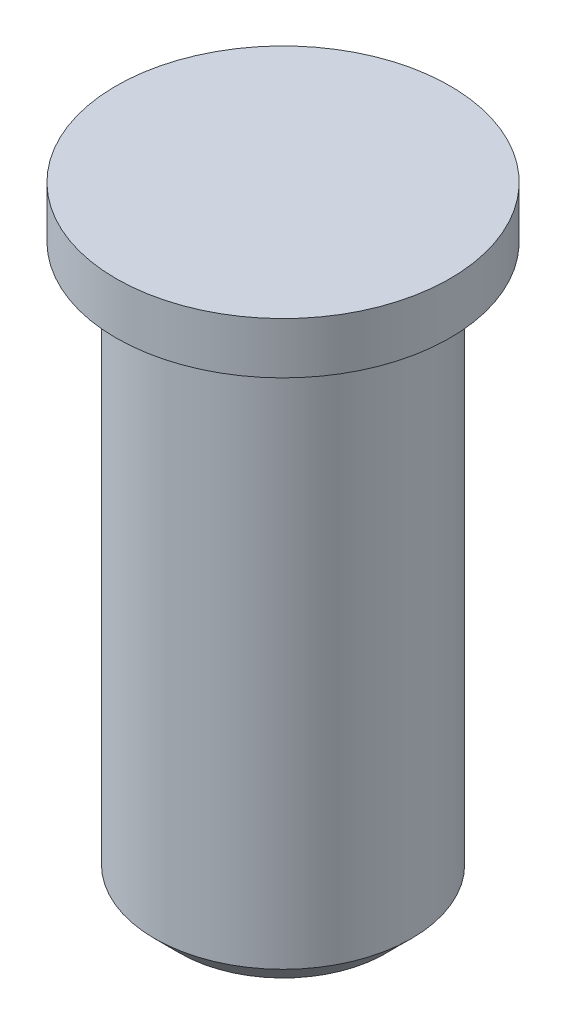
ISO-10303-21;
HEADER;
FILE_DESCRIPTION(('STEP AP214'),'2;1');
FILE_NAME('part.step','',(''),(''),'','','');
FILE_SCHEMA(('AUTOMOTIVE_DESIGN { 1 0 10303 214 1 1 1 1 }'));
ENDSEC;
DATA;
#1=APPLICATION_CONTEXT('core data for automotive mechanical design processes');
#2=APPLICATION_PROTOCOL_DEFINITION('international standard','automotive_design',2000,#1);
#3=PRODUCT_CONTEXT('',#1,'mechanical');
#4=PRODUCT('Part','Part','',(#3));
#5=PRODUCT_RELATED_PRODUCT_CATEGORY('part','',(#4));
#6=PRODUCT_DEFINITION_FORMATION('','',#4);
#7=PRODUCT_DEFINITION_CONTEXT('part definition',#1,'design');
#8=PRODUCT_DEFINITION('design','',#6,#7);
#9=PRODUCT_DEFINITION_SHAPE('','',#8);
#10=(LENGTH_UNIT() NAMED_UNIT(*) SI_UNIT(.MILLI.,.METRE.));
#11=(NAMED_UNIT(*) PLANE_ANGLE_UNIT() SI_UNIT($,.RADIAN.));
#12=(NAMED_UNIT(*) SI_UNIT($,.STERADIAN.) SOLID_ANGLE_UNIT());
#13=UNCERTAINTY_MEASURE_WITH_UNIT(LENGTH_MEASURE(1.E-05),#10,'distance_accuracy_value','');
#14=(GEOMETRIC_REPRESENTATION_CONTEXT(3) GLOBAL_UNCERTAINTY_ASSIGNED_CONTEXT((#13)) GLOBAL_UNIT_ASSIGNED_CONTEXT((#10,
#11,#12)) REPRESENTATION_CONTEXT('',''));
#15=CARTESIAN_POINT('',(0.,0.,0.));
#16=DIRECTION('',(0.,0.,1.));
#17=DIRECTION('',(1.,0.,0.));
#18=AXIS2_PLACEMENT_3D('',#15,#16,#17);
#19=CARTESIAN_POINT('',(0.,0.,0.));
#20=DIRECTION('',(0.,-1.,0.));
#21=DIRECTION('',(0.,0.,-1.));
#22=AXIS2_PLACEMENT_3D('',#19,#20,#21);
#23=PLANE('',#22);
#24=CARTESIAN_POINT('',(0.,0.,0.));
#25=DIRECTION('',(0.,1.,0.));
#26=DIRECTION('',(0.,0.,1.));
#27=AXIS2_PLACEMENT_3D('',#24,#25,#26);
#28=CIRCLE('',#27,3.25);
#29=CARTESIAN_POINT('',(0.,0.,3.25));
#30=VERTEX_POINT('',#29);
#31=EDGE_CURVE('E43',#30,#30,#28,.T.);
#32=ORIENTED_EDGE('',*,*,#31,.T.);
#33=EDGE_LOOP('',(#32));
#34=FACE_BOUND('',#33,.T.);
#35=ADVANCED_FACE('F32',(#34),#23,.F.);
#36=CARTESIAN_POINT('',(0.,0.,0.));
#37=DIRECTION('',(0.,1.,0.));
#38=DIRECTION('',(0.,0.,1.));
#39=AXIS2_PLACEMENT_3D('',#36,#37,#38);
#40=CYLINDRICAL_SURFACE('',#39,3.25);
#41=ORIENTED_EDGE('',*,*,#31,.F.);
#42=EDGE_LOOP('',(#41));
#43=FACE_BOUND('',#42,.T.);
#44=CARTESIAN_POINT('',(0.,-1.,0.));
#45=DIRECTION('',(0.,1.,0.));
#46=DIRECTION('',(0.,0.,1.));
#47=AXIS2_PLACEMENT_3D('',#44,#45,#46);
#48=CIRCLE('',#47,3.25);
#49=CARTESIAN_POINT('',(0.,-1.,3.25));
#50=VERTEX_POINT('',#49);
#51=EDGE_CURVE('E47',#50,#50,#48,.T.);
#52=ORIENTED_EDGE('',*,*,#51,.T.);
#53=EDGE_LOOP('',(#52));
#54=FACE_BOUND('',#53,.T.);
#55=ADVANCED_FACE('F67',(#43,#54),#40,.T.);
#56=CARTESIAN_POINT('',(3.25,-1.,0.));
#57=DIRECTION('',(0.,1.,0.));
#58=DIRECTION('',(0.,0.,1.));
#59=AXIS2_PLACEMENT_3D('',#56,#57,#58);
#60=PLANE('',#59);
#61=ORIENTED_EDGE('',*,*,#51,.F.);
#62=EDGE_LOOP('',(#61));
#63=FACE_BOUND('',#62,.T.);
#64=CARTESIAN_POINT('',(0.,-1.,0.));
#65=DIRECTION('',(0.,1.,0.));
#66=DIRECTION('',(0.,0.,1.));
#67=AXIS2_PLACEMENT_3D('',#64,#65,#66);
#68=CIRCLE('',#67,2.5);
#69=CARTESIAN_POINT('',(0.,-1.,2.5));
#70=VERTEX_POINT('',#69);
#71=EDGE_CURVE('E52',#70,#70,#68,.T.);
#72=ORIENTED_EDGE('',*,*,#71,.T.);
#73=EDGE_LOOP('',(#72));
#74=FACE_BOUND('',#73,.T.);
#75=ADVANCED_FACE('F56',(#63,#74),#60,.F.);
#76=CARTESIAN_POINT('',(0.,0.,0.));
#77=DIRECTION('',(0.,1.,0.));
#78=DIRECTION('',(0.,0.,1.));
#79=AXIS2_PLACEMENT_3D('',#76,#77,#78);
#80=CYLINDRICAL_SURFACE('',#79,2.5);
#81=CARTESIAN_POINT('',(0.,-11.5,0.));
#82=DIRECTION('',(0.,1.,0.));
#83=DIRECTION('',(0.,0.,1.));
#84=AXIS2_PLACEMENT_3D('',#81,#82,#83);
#85=CIRCLE('',#84,2.5);
#86=CARTESIAN_POINT('',(0.,-11.5,2.5));
#87=VERTEX_POINT('',#86);
#88=EDGE_CURVE('E39',#87,#87,#85,.T.);
#89=ORIENTED_EDGE('',*,*,#88,.T.);
#90=EDGE_LOOP('',(#89));
#91=FACE_BOUND('',#90,.T.);
#92=ORIENTED_EDGE('',*,*,#71,.F.);
#93=EDGE_LOOP('',(#92));
#94=FACE_BOUND('',#93,.T.);
#95=ADVANCED_FACE('F58',(#91,#94),#80,.T.);
#96=CARTESIAN_POINT('',(2.5,-12.,0.));
#97=DIRECTION('',(0.,1.,0.));
#98=DIRECTION('',(0.,0.,1.));
#99=AXIS2_PLACEMENT_3D('',#96,#97,#98);
#100=PLANE('',#99);
#101=CARTESIAN_POINT('',(0.,-12.,0.));
#102=DIRECTION('',(0.,1.,0.));
#103=DIRECTION('',(0.,0.,1.));
#104=AXIS2_PLACEMENT_3D('',#101,#102,#103);
#105=CIRCLE('',#104,2.);
#106=CARTESIAN_POINT('',(0.,-12.,2.));
#107=VERTEX_POINT('',#106);
#108=EDGE_CURVE('E10',#107,#107,#105,.F.);
#109=ORIENTED_EDGE('',*,*,#108,.T.);
#110=EDGE_LOOP('',(#109));
#111=FACE_BOUND('',#110,.T.);
#112=ADVANCED_FACE('F60',(#111),#100,.F.);
#113=CARTESIAN_POINT('',(0.,-11.5,0.));
#114=DIRECTION('',(0.,1.,0.));
#115=DIRECTION('',(0.,0.,1.));
#116=AXIS2_PLACEMENT_3D('',#113,#114,#115);
#117=CONICAL_SURFACE('',#116,2.5,0.785398163397449);
#118=ORIENTED_EDGE('',*,*,#108,.F.);
#119=EDGE_LOOP('',(#118));
#120=FACE_BOUND('',#119,.T.);
#121=ORIENTED_EDGE('',*,*,#88,.F.);
#122=EDGE_LOOP('',(#121));
#123=FACE_BOUND('',#122,.T.);
#124=ADVANCED_FACE('F34',(#120,#123),#117,.T.);
#125=CLOSED_SHELL('',(#35,#55,#75,#95,#112,#124));
#126=MANIFOLD_SOLID_BREP('B2',#125);
#127=ADVANCED_BREP_SHAPE_REPRESENTATION('',(#18,#126),#14);
#128=SHAPE_DEFINITION_REPRESENTATION(#9,#127);
ENDSEC;
END-ISO-10303-21;
